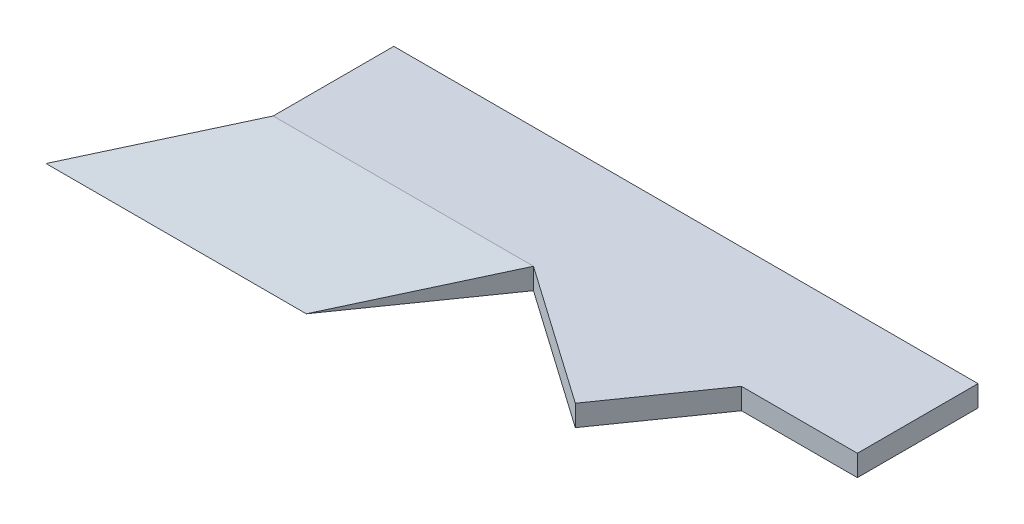
ISO-10303-21;
HEADER;
FILE_DESCRIPTION(('STEP AP214'),'2;1');
FILE_NAME('part.step','',(''),(''),'','','');
FILE_SCHEMA(('AUTOMOTIVE_DESIGN { 1 0 10303 214 1 1 1 1 }'));
ENDSEC;
DATA;
#1=APPLICATION_CONTEXT('core data for automotive mechanical design processes');
#2=APPLICATION_PROTOCOL_DEFINITION('international standard','automotive_design',2000,#1);
#3=PRODUCT_CONTEXT('',#1,'mechanical');
#4=PRODUCT('Part','Part','',(#3));
#5=PRODUCT_RELATED_PRODUCT_CATEGORY('part','',(#4));
#6=PRODUCT_DEFINITION_FORMATION('','',#4);
#7=PRODUCT_DEFINITION_CONTEXT('part definition',#1,'design');
#8=PRODUCT_DEFINITION('design','',#6,#7);
#9=PRODUCT_DEFINITION_SHAPE('','',#8);
#10=(LENGTH_UNIT() NAMED_UNIT(*) SI_UNIT(.MILLI.,.METRE.));
#11=(NAMED_UNIT(*) PLANE_ANGLE_UNIT() SI_UNIT($,.RADIAN.));
#12=(NAMED_UNIT(*) SI_UNIT($,.STERADIAN.) SOLID_ANGLE_UNIT());
#13=UNCERTAINTY_MEASURE_WITH_UNIT(LENGTH_MEASURE(1.E-05),#10,'distance_accuracy_value','');
#14=(GEOMETRIC_REPRESENTATION_CONTEXT(3) GLOBAL_UNCERTAINTY_ASSIGNED_CONTEXT((#13)) GLOBAL_UNIT_ASSIGNED_CONTEXT((#10,
#11,#12)) REPRESENTATION_CONTEXT('',''));
#15=CARTESIAN_POINT('',(0.,0.,0.));
#16=DIRECTION('',(0.,0.,1.));
#17=DIRECTION('',(1.,0.,0.));
#18=AXIS2_PLACEMENT_3D('',#15,#16,#17);
#19=CARTESIAN_POINT('',(0.,0.,0.));
#20=DIRECTION('',(0.,1.,0.));
#21=DIRECTION('',(0.,0.,1.));
#22=AXIS2_PLACEMENT_3D('',#19,#20,#21);
#23=PLANE('',#22);
#24=DIRECTION('',(-0.57357643635105,0.,0.819152044288989));
#25=VECTOR('',#24,1.);
#26=CARTESIAN_POINT('',(-1584.51090590126,0.,-1109.48648068757));
#27=LINE('',#26,#25);
#28=CARTESIAN_POINT('',(-2760.5,0.,570.));
#29=VERTEX_POINT('',#28);
#30=CARTESIAN_POINT('',(-3644.68728099174,0.,1832.75030293506));
#31=VERTEX_POINT('',#30);
#32=EDGE_CURVE('E52',#29,#31,#27,.T.);
#33=ORIENTED_EDGE('',*,*,#32,.F.);
#34=DIRECTION('',(0.,0.,1.));
#35=VECTOR('',#34,1.);
#36=CARTESIAN_POINT('',(-2760.5,0.,-570.));
#37=LINE('',#36,#35);
#38=CARTESIAN_POINT('',(-2760.5,0.,-570.));
#39=VERTEX_POINT('',#38);
#40=EDGE_CURVE('E99',#39,#29,#37,.T.);
#41=ORIENTED_EDGE('',*,*,#40,.F.);
#42=DIRECTION('',(1.,0.,0.));
#43=VECTOR('',#42,1.);
#44=CARTESIAN_POINT('',(-2760.5,0.,-570.));
#45=LINE('',#44,#43);
#46=CARTESIAN_POINT('',(2760.5,0.,-570.));
#47=VERTEX_POINT('',#46);
#48=EDGE_CURVE('E112',#39,#47,#45,.T.);
#49=ORIENTED_EDGE('',*,*,#48,.T.);
#50=DIRECTION('',(0.,0.,1.));
#51=VECTOR('',#50,1.);
#52=CARTESIAN_POINT('',(2760.5,0.,-570.));
#53=LINE('',#52,#51);
#54=CARTESIAN_POINT('',(2760.5,0.,570.));
#55=VERTEX_POINT('',#54);
#56=EDGE_CURVE('E118',#47,#55,#53,.T.);
#57=ORIENTED_EDGE('',*,*,#56,.T.);
#58=DIRECTION('',(1.,0.,0.));
#59=VECTOR('',#58,1.);
#60=CARTESIAN_POINT('',(-2760.5,0.,570.));
#61=LINE('',#60,#59);
#62=CARTESIAN_POINT('',(1664.94,0.,570.));
#63=VERTEX_POINT('',#62);
#64=EDGE_CURVE('E120',#63,#55,#61,.T.);
#65=ORIENTED_EDGE('',*,*,#64,.F.);
#66=DIRECTION('',(-0.57357643635105,0.,0.819152044288989));
#67=VECTOR('',#66,1.);
#68=CARTESIAN_POINT('',(1385.0039056383,0.,969.790175177835));
#69=LINE('',#68,#67);
#70=CARTESIAN_POINT('',(1018.33003524899,0.,1493.45473229873));
#71=VERTEX_POINT('',#70);
#72=EDGE_CURVE('E132',#63,#71,#69,.T.);
#73=ORIENTED_EDGE('',*,*,#72,.T.);
#74=DIRECTION('',(-0.819152044288989,0.,-0.57357643635105));
#75=VECTOR('',#74,1.);
#76=CARTESIAN_POINT('',(-366.673870389304,0.,523.664557120896));
#77=LINE('',#76,#75);
#78=CARTESIAN_POINT('',(-300.5,0.,570.));
#79=VERTEX_POINT('',#78);
#80=EDGE_CURVE('E127',#71,#79,#77,.T.);
#81=ORIENTED_EDGE('',*,*,#80,.T.);
#82=DIRECTION('',(-0.57357643635105,0.,0.819152044288989));
#83=VECTOR('',#82,1.);
#84=CARTESIAN_POINT('',(66.1738703893043,0.,46.3354428791037));
#85=LINE('',#84,#83);
#86=CARTESIAN_POINT('',(-1184.68728099174,0.,1832.75030293506));
#87=VERTEX_POINT('',#86);
#88=EDGE_CURVE('E185',#79,#87,#85,.T.);
#89=ORIENTED_EDGE('',*,*,#88,.T.);
#90=DIRECTION('',(1.,0.,0.));
#91=VECTOR('',#90,1.);
#92=CARTESIAN_POINT('',(-3760.5,0.,1832.75030293506));
#93=LINE('',#92,#91);
#94=EDGE_CURVE('E155',#31,#87,#93,.T.);
#95=ORIENTED_EDGE('',*,*,#94,.F.);
#96=EDGE_LOOP('',(#33,#41,#49,#57,#65,#73,#81,#89,#95));
#97=FACE_BOUND('',#96,.T.);
#98=ADVANCED_FACE('F38',(#97),#23,.F.);
#99=CARTESIAN_POINT('',(-3760.5,0.,1832.75030293506));
#100=DIRECTION('',(0.,-0.987688340595139,-0.156434465040224));
#101=DIRECTION('',(0.,0.156434465040224,-0.987688340595139));
#102=AXIS2_PLACEMENT_3D('',#99,#100,#101);
#103=PLANE('',#102);
#104=DIRECTION('',(0.568809114643902,0.128662586959158,-0.812343603295427));
#105=VECTOR('',#104,1.);
#106=CARTESIAN_POINT('',(-3682.15776921896,-8.47569039563656,1886.26370600843));
#107=LINE('',#106,#105);
#108=CARTESIAN_POINT('',(-2760.5,200.,570.));
#109=VERTEX_POINT('',#108);
#110=EDGE_CURVE('E11',#31,#109,#107,.T.);
#111=ORIENTED_EDGE('',*,*,#110,.F.);
#112=ORIENTED_EDGE('',*,*,#94,.T.);
#113=DIRECTION('',(0.568809114643902,0.128662586959158,-0.812343603295427));
#114=VECTOR('',#113,1.);
#115=CARTESIAN_POINT('',(-2018.07553911783,-188.509442748676,3022.95208262012));
#116=LINE('',#115,#114);
#117=CARTESIAN_POINT('',(-300.500000000001,200.,570.));
#118=VERTEX_POINT('',#117);
#119=EDGE_CURVE('E159',#87,#118,#116,.T.);
#120=ORIENTED_EDGE('',*,*,#119,.T.);
#121=DIRECTION('',(1.,0.,0.));
#122=VECTOR('',#121,1.);
#123=CARTESIAN_POINT('',(-2760.5,200.,570.));
#124=LINE('',#123,#122);
#125=EDGE_CURVE('E148',#109,#118,#124,.T.);
#126=ORIENTED_EDGE('',*,*,#125,.F.);
#127=EDGE_LOOP('',(#111,#112,#120,#126));
#128=FACE_BOUND('',#127,.T.);
#129=ADVANCED_FACE('F178',(#128),#103,.F.);
#130=CARTESIAN_POINT('',(-366.673870389304,200.,523.664557120896));
#131=DIRECTION('',(-0.57357643635105,0.,0.819152044288989));
#132=DIRECTION('',(0.819152044288989,0.,0.57357643635105));
#133=AXIS2_PLACEMENT_3D('',#130,#131,#132);
#134=PLANE('',#133);
#135=ORIENTED_EDGE('',*,*,#80,.F.);
#136=DIRECTION('',(0.,-1.,0.));
#137=VECTOR('',#136,1.);
#138=CARTESIAN_POINT('',(1018.33003524899,200.,1493.45473229873));
#139=LINE('',#138,#137);
#140=CARTESIAN_POINT('',(1018.33003524899,200.,1493.45473229873));
#141=VERTEX_POINT('',#140);
#142=EDGE_CURVE('E46',#141,#71,#139,.T.);
#143=ORIENTED_EDGE('',*,*,#142,.F.);
#144=DIRECTION('',(-0.819152044288989,0.,-0.57357643635105));
#145=VECTOR('',#144,1.);
#146=CARTESIAN_POINT('',(-366.673870389304,200.,523.664557120896));
#147=LINE('',#146,#145);
#148=EDGE_CURVE('E137',#141,#118,#147,.T.);
#149=ORIENTED_EDGE('',*,*,#148,.T.);
#150=DIRECTION('',(0.,-1.,0.));
#151=VECTOR('',#150,1.);
#152=CARTESIAN_POINT('',(-300.5,200.,570.));
#153=LINE('',#152,#151);
#154=EDGE_CURVE('E143',#118,#79,#153,.T.);
#155=ORIENTED_EDGE('',*,*,#154,.T.);
#156=EDGE_LOOP('',(#135,#143,#149,#155));
#157=FACE_BOUND('',#156,.T.);
#158=ADVANCED_FACE('F187',(#157),#134,.T.);
#159=CARTESIAN_POINT('',(1385.0039056383,200.,969.790175177835));
#160=DIRECTION('',(0.819152044288989,0.,0.57357643635105));
#161=DIRECTION('',(0.57357643635105,0.,-0.819152044288989));
#162=AXIS2_PLACEMENT_3D('',#159,#160,#161);
#163=PLANE('',#162);
#164=ORIENTED_EDGE('',*,*,#72,.F.);
#165=DIRECTION('',(0.,-1.,0.));
#166=VECTOR('',#165,1.);
#167=CARTESIAN_POINT('',(1664.94,200.,570.));
#168=LINE('',#167,#166);
#169=CARTESIAN_POINT('',(1664.94,200.,570.));
#170=VERTEX_POINT('',#169);
#171=EDGE_CURVE('E61',#170,#63,#168,.T.);
#172=ORIENTED_EDGE('',*,*,#171,.F.);
#173=DIRECTION('',(-0.57357643635105,0.,0.819152044288989));
#174=VECTOR('',#173,1.);
#175=CARTESIAN_POINT('',(1385.0039056383,200.,969.790175177835));
#176=LINE('',#175,#174);
#177=EDGE_CURVE('E140',#170,#141,#176,.T.);
#178=ORIENTED_EDGE('',*,*,#177,.T.);
#179=ORIENTED_EDGE('',*,*,#142,.T.);
#180=EDGE_LOOP('',(#164,#172,#178,#179));
#181=FACE_BOUND('',#180,.T.);
#182=ADVANCED_FACE('F171',(#181),#163,.T.);
#183=CARTESIAN_POINT('',(0.,200.,0.));
#184=DIRECTION('',(0.,1.,0.));
#185=DIRECTION('',(0.,0.,1.));
#186=AXIS2_PLACEMENT_3D('',#183,#184,#185);
#187=PLANE('',#186);
#188=ORIENTED_EDGE('',*,*,#148,.F.);
#189=ORIENTED_EDGE('',*,*,#177,.F.);
#190=CARTESIAN_POINT('',(2760.5,200.,570.));
#191=VERTEX_POINT('',#190);
#192=EDGE_CURVE('E114',#170,#191,#124,.T.);
#193=ORIENTED_EDGE('',*,*,#192,.T.);
#194=DIRECTION('',(0.,0.,1.));
#195=VECTOR('',#194,1.);
#196=CARTESIAN_POINT('',(2760.5,200.,-570.));
#197=LINE('',#196,#195);
#198=CARTESIAN_POINT('',(2760.5,200.,-570.));
#199=VERTEX_POINT('',#198);
#200=EDGE_CURVE('E151',#199,#191,#197,.T.);
#201=ORIENTED_EDGE('',*,*,#200,.F.);
#202=DIRECTION('',(1.,0.,0.));
#203=VECTOR('',#202,1.);
#204=CARTESIAN_POINT('',(-2760.5,200.,-570.));
#205=LINE('',#204,#203);
#206=CARTESIAN_POINT('',(-2760.5,200.,-570.));
#207=VERTEX_POINT('',#206);
#208=EDGE_CURVE('E153',#207,#199,#205,.T.);
#209=ORIENTED_EDGE('',*,*,#208,.F.);
#210=DIRECTION('',(0.,0.,1.));
#211=VECTOR('',#210,1.);
#212=CARTESIAN_POINT('',(-2760.5,200.,-570.));
#213=LINE('',#212,#211);
#214=EDGE_CURVE('E101',#207,#109,#213,.T.);
#215=ORIENTED_EDGE('',*,*,#214,.T.);
#216=ORIENTED_EDGE('',*,*,#125,.T.);
#217=EDGE_LOOP('',(#188,#189,#193,#201,#209,#215,#216));
#218=FACE_BOUND('',#217,.T.);
#219=ADVANCED_FACE('F173',(#218),#187,.T.);
#220=CARTESIAN_POINT('',(-2760.5,200.,-570.));
#221=DIRECTION('',(0.,0.,-1.));
#222=DIRECTION('',(-1.,0.,0.));
#223=AXIS2_PLACEMENT_3D('',#220,#221,#222);
#224=PLANE('',#223);
#225=ORIENTED_EDGE('',*,*,#48,.F.);
#226=DIRECTION('',(0.,-1.,0.));
#227=VECTOR('',#226,1.);
#228=CARTESIAN_POINT('',(-2760.5,200.,-570.));
#229=LINE('',#228,#227);
#230=EDGE_CURVE('E95',#207,#39,#229,.T.);
#231=ORIENTED_EDGE('',*,*,#230,.F.);
#232=ORIENTED_EDGE('',*,*,#208,.T.);
#233=DIRECTION('',(0.,-1.,0.));
#234=VECTOR('',#233,1.);
#235=CARTESIAN_POINT('',(2760.5,200.,-570.));
#236=LINE('',#235,#234);
#237=EDGE_CURVE('E106',#199,#47,#236,.T.);
#238=ORIENTED_EDGE('',*,*,#237,.T.);
#239=EDGE_LOOP('',(#225,#231,#232,#238));
#240=FACE_BOUND('',#239,.T.);
#241=ADVANCED_FACE('F116',(#240),#224,.T.);
#242=CARTESIAN_POINT('',(-2760.5,200.,-570.));
#243=DIRECTION('',(1.,0.,0.));
#244=DIRECTION('',(0.,0.,-1.));
#245=AXIS2_PLACEMENT_3D('',#242,#243,#244);
#246=PLANE('',#245);
#247=ORIENTED_EDGE('',*,*,#40,.T.);
#248=DIRECTION('',(0.,-1.,0.));
#249=VECTOR('',#248,1.);
#250=CARTESIAN_POINT('',(-2760.5,200.,570.));
#251=LINE('',#250,#249);
#252=EDGE_CURVE('E107',#109,#29,#251,.T.);
#253=ORIENTED_EDGE('',*,*,#252,.F.);
#254=ORIENTED_EDGE('',*,*,#214,.F.);
#255=ORIENTED_EDGE('',*,*,#230,.T.);
#256=EDGE_LOOP('',(#247,#253,#254,#255));
#257=FACE_BOUND('',#256,.T.);
#258=ADVANCED_FACE('F97',(#257),#246,.F.);
#259=CARTESIAN_POINT('',(2760.5,200.,-570.));
#260=DIRECTION('',(1.,0.,0.));
#261=DIRECTION('',(0.,0.,-1.));
#262=AXIS2_PLACEMENT_3D('',#259,#260,#261);
#263=PLANE('',#262);
#264=ORIENTED_EDGE('',*,*,#56,.F.);
#265=ORIENTED_EDGE('',*,*,#237,.F.);
#266=ORIENTED_EDGE('',*,*,#200,.T.);
#267=DIRECTION('',(0.,-1.,0.));
#268=VECTOR('',#267,1.);
#269=CARTESIAN_POINT('',(2760.5,200.,570.));
#270=LINE('',#269,#268);
#271=EDGE_CURVE('E125',#191,#55,#270,.T.);
#272=ORIENTED_EDGE('',*,*,#271,.T.);
#273=EDGE_LOOP('',(#264,#265,#266,#272));
#274=FACE_BOUND('',#273,.T.);
#275=ADVANCED_FACE('F188',(#274),#263,.T.);
#276=CARTESIAN_POINT('',(-2760.5,200.,570.));
#277=DIRECTION('',(0.,0.,-1.));
#278=DIRECTION('',(-1.,0.,0.));
#279=AXIS2_PLACEMENT_3D('',#276,#277,#278);
#280=PLANE('',#279);
#281=ORIENTED_EDGE('',*,*,#192,.F.);
#282=ORIENTED_EDGE('',*,*,#171,.T.);
#283=ORIENTED_EDGE('',*,*,#64,.T.);
#284=ORIENTED_EDGE('',*,*,#271,.F.);
#285=EDGE_LOOP('',(#281,#282,#283,#284));
#286=FACE_BOUND('',#285,.T.);
#287=ADVANCED_FACE('F40',(#286),#280,.F.);
#288=CARTESIAN_POINT('',(66.1738703893043,0.,46.3354428791037));
#289=DIRECTION('',(-0.819152044288989,0.,-0.57357643635105));
#290=DIRECTION('',(-0.57357643635105,0.,0.819152044288989));
#291=AXIS2_PLACEMENT_3D('',#288,#289,#290);
#292=PLANE('',#291);
#293=ORIENTED_EDGE('',*,*,#88,.F.);
#294=ORIENTED_EDGE('',*,*,#154,.F.);
#295=ORIENTED_EDGE('',*,*,#119,.F.);
#296=EDGE_LOOP('',(#293,#294,#295));
#297=FACE_BOUND('',#296,.T.);
#298=ADVANCED_FACE('F184',(#297),#292,.F.);
#299=CARTESIAN_POINT('',(-1584.51090590126,0.,-1109.48648068757));
#300=DIRECTION('',(-0.819152044288989,0.,-0.57357643635105));
#301=DIRECTION('',(-0.57357643635105,0.,0.819152044288989));
#302=AXIS2_PLACEMENT_3D('',#299,#300,#301);
#303=PLANE('',#302);
#304=ORIENTED_EDGE('',*,*,#110,.T.);
#305=ORIENTED_EDGE('',*,*,#252,.T.);
#306=ORIENTED_EDGE('',*,*,#32,.T.);
#307=EDGE_LOOP('',(#304,#305,#306));
#308=FACE_BOUND('',#307,.T.);
#309=ADVANCED_FACE('F241',(#308),#303,.T.);
#310=CLOSED_SHELL('',(#98,#129,#158,#182,#219,#241,#258,#275,#287,#298,#309));
#311=MANIFOLD_SOLID_BREP('B2',#310);
#312=ADVANCED_BREP_SHAPE_REPRESENTATION('',(#18,#311),#14);
#313=SHAPE_DEFINITION_REPRESENTATION(#9,#312);
ENDSEC;
END-ISO-10303-21;
